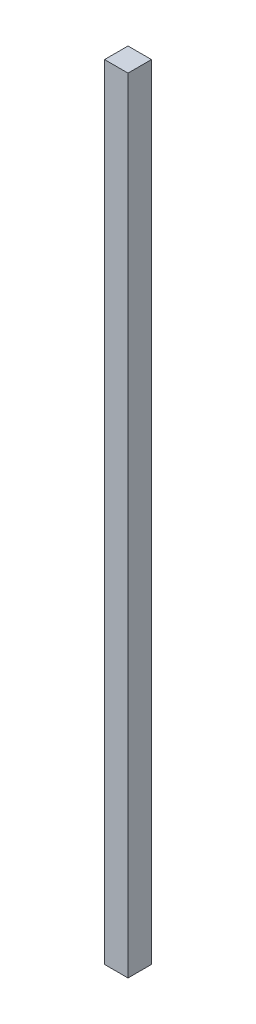
ISO-10303-21;
HEADER;
FILE_DESCRIPTION(('STEP AP214'),'2;1');
FILE_NAME('part.step','',(''),(''),'','','');
FILE_SCHEMA(('AUTOMOTIVE_DESIGN { 1 0 10303 214 1 1 1 1 }'));
ENDSEC;
DATA;
#1=APPLICATION_CONTEXT('core data for automotive mechanical design processes');
#2=APPLICATION_PROTOCOL_DEFINITION('international standard','automotive_design',2000,#1);
#3=PRODUCT_CONTEXT('',#1,'mechanical');
#4=PRODUCT('Part','Part','',(#3));
#5=PRODUCT_RELATED_PRODUCT_CATEGORY('part','',(#4));
#6=PRODUCT_DEFINITION_FORMATION('','',#4);
#7=PRODUCT_DEFINITION_CONTEXT('part definition',#1,'design');
#8=PRODUCT_DEFINITION('design','',#6,#7);
#9=PRODUCT_DEFINITION_SHAPE('','',#8);
#10=(LENGTH_UNIT() NAMED_UNIT(*) SI_UNIT(.MILLI.,.METRE.));
#11=(NAMED_UNIT(*) PLANE_ANGLE_UNIT() SI_UNIT($,.RADIAN.));
#12=(NAMED_UNIT(*) SI_UNIT($,.STERADIAN.) SOLID_ANGLE_UNIT());
#13=UNCERTAINTY_MEASURE_WITH_UNIT(LENGTH_MEASURE(1.E-05),#10,'distance_accuracy_value','');
#14=(GEOMETRIC_REPRESENTATION_CONTEXT(3) GLOBAL_UNCERTAINTY_ASSIGNED_CONTEXT((#13)) GLOBAL_UNIT_ASSIGNED_CONTEXT((#10,
#11,#12)) REPRESENTATION_CONTEXT('',''));
#15=CARTESIAN_POINT('',(0.,0.,0.));
#16=DIRECTION('',(0.,0.,1.));
#17=DIRECTION('',(1.,0.,0.));
#18=AXIS2_PLACEMENT_3D('',#15,#16,#17);
#19=CARTESIAN_POINT('',(-5.,334.,-5.));
#20=DIRECTION('',(1.,0.,0.));
#21=DIRECTION('',(0.,0.,-1.));
#22=AXIS2_PLACEMENT_3D('',#19,#20,#21);
#23=PLANE('',#22);
#24=DIRECTION('',(0.,0.,1.));
#25=VECTOR('',#24,1.);
#26=CARTESIAN_POINT('',(-5.,0.,-5.));
#27=LINE('',#26,#25);
#28=CARTESIAN_POINT('',(-5.,0.,-5.));
#29=VERTEX_POINT('',#28);
#30=CARTESIAN_POINT('',(-5.,0.,5.));
#31=VERTEX_POINT('',#30);
#32=EDGE_CURVE('E98',#29,#31,#27,.T.);
#33=ORIENTED_EDGE('',*,*,#32,.T.);
#34=DIRECTION('',(0.,-1.,0.));
#35=VECTOR('',#34,1.);
#36=CARTESIAN_POINT('',(-5.,334.,5.));
#37=LINE('',#36,#35);
#38=CARTESIAN_POINT('',(-5.,334.,5.));
#39=VERTEX_POINT('',#38);
#40=EDGE_CURVE('E11',#39,#31,#37,.T.);
#41=ORIENTED_EDGE('',*,*,#40,.F.);
#42=DIRECTION('',(0.,0.,1.));
#43=VECTOR('',#42,1.);
#44=CARTESIAN_POINT('',(-5.,334.,-5.));
#45=LINE('',#44,#43);
#46=CARTESIAN_POINT('',(-5.,334.,-5.));
#47=VERTEX_POINT('',#46);
#48=EDGE_CURVE('E86',#47,#39,#45,.T.);
#49=ORIENTED_EDGE('',*,*,#48,.F.);
#50=DIRECTION('',(0.,-1.,0.));
#51=VECTOR('',#50,1.);
#52=CARTESIAN_POINT('',(-5.,334.,-5.));
#53=LINE('',#52,#51);
#54=EDGE_CURVE('E94',#47,#29,#53,.T.);
#55=ORIENTED_EDGE('',*,*,#54,.T.);
#56=EDGE_LOOP('',(#33,#41,#49,#55));
#57=FACE_BOUND('',#56,.T.);
#58=ADVANCED_FACE('F35',(#57),#23,.F.);
#59=CARTESIAN_POINT('',(5.,334.,5.));
#60=DIRECTION('',(0.,0.,-1.));
#61=DIRECTION('',(-1.,0.,0.));
#62=AXIS2_PLACEMENT_3D('',#59,#60,#61);
#63=PLANE('',#62);
#64=DIRECTION('',(1.,0.,0.));
#65=VECTOR('',#64,1.);
#66=CARTESIAN_POINT('',(5.,0.,5.));
#67=LINE('',#66,#65);
#68=CARTESIAN_POINT('',(5.,0.,5.));
#69=VERTEX_POINT('',#68);
#70=EDGE_CURVE('E90',#31,#69,#67,.T.);
#71=ORIENTED_EDGE('',*,*,#70,.T.);
#72=DIRECTION('',(0.,-1.,0.));
#73=VECTOR('',#72,1.);
#74=CARTESIAN_POINT('',(5.,334.,5.));
#75=LINE('',#74,#73);
#76=CARTESIAN_POINT('',(5.,334.,5.));
#77=VERTEX_POINT('',#76);
#78=EDGE_CURVE('E43',#77,#69,#75,.T.);
#79=ORIENTED_EDGE('',*,*,#78,.F.);
#80=DIRECTION('',(1.,0.,0.));
#81=VECTOR('',#80,1.);
#82=CARTESIAN_POINT('',(5.,334.,5.));
#83=LINE('',#82,#81);
#84=EDGE_CURVE('E81',#39,#77,#83,.T.);
#85=ORIENTED_EDGE('',*,*,#84,.F.);
#86=ORIENTED_EDGE('',*,*,#40,.T.);
#87=EDGE_LOOP('',(#71,#79,#85,#86));
#88=FACE_BOUND('',#87,.T.);
#89=ADVANCED_FACE('F89',(#88),#63,.F.);
#90=CARTESIAN_POINT('',(5.,334.,-5.));
#91=DIRECTION('',(-1.,0.,0.));
#92=DIRECTION('',(0.,0.,1.));
#93=AXIS2_PLACEMENT_3D('',#90,#91,#92);
#94=PLANE('',#93);
#95=DIRECTION('',(0.,0.,-1.));
#96=VECTOR('',#95,1.);
#97=CARTESIAN_POINT('',(5.,0.,-5.));
#98=LINE('',#97,#96);
#99=CARTESIAN_POINT('',(5.,0.,-5.));
#100=VERTEX_POINT('',#99);
#101=EDGE_CURVE('E68',#69,#100,#98,.T.);
#102=ORIENTED_EDGE('',*,*,#101,.T.);
#103=DIRECTION('',(0.,-1.,0.));
#104=VECTOR('',#103,1.);
#105=CARTESIAN_POINT('',(5.,334.,-5.));
#106=LINE('',#105,#104);
#107=CARTESIAN_POINT('',(5.,334.,-5.));
#108=VERTEX_POINT('',#107);
#109=EDGE_CURVE('E91',#108,#100,#106,.T.);
#110=ORIENTED_EDGE('',*,*,#109,.F.);
#111=DIRECTION('',(0.,0.,-1.));
#112=VECTOR('',#111,1.);
#113=CARTESIAN_POINT('',(5.,334.,-5.));
#114=LINE('',#113,#112);
#115=EDGE_CURVE('E84',#77,#108,#114,.T.);
#116=ORIENTED_EDGE('',*,*,#115,.F.);
#117=ORIENTED_EDGE('',*,*,#78,.T.);
#118=EDGE_LOOP('',(#102,#110,#116,#117));
#119=FACE_BOUND('',#118,.T.);
#120=ADVANCED_FACE('F92',(#119),#94,.F.);
#121=CARTESIAN_POINT('',(5.,334.,-5.));
#122=DIRECTION('',(0.,0.,1.));
#123=DIRECTION('',(1.,0.,0.));
#124=AXIS2_PLACEMENT_3D('',#121,#122,#123);
#125=PLANE('',#124);
#126=DIRECTION('',(-1.,0.,0.));
#127=VECTOR('',#126,1.);
#128=CARTESIAN_POINT('',(5.,0.,-5.));
#129=LINE('',#128,#127);
#130=EDGE_CURVE('E74',#100,#29,#129,.T.);
#131=ORIENTED_EDGE('',*,*,#130,.T.);
#132=ORIENTED_EDGE('',*,*,#54,.F.);
#133=DIRECTION('',(-1.,0.,0.));
#134=VECTOR('',#133,1.);
#135=CARTESIAN_POINT('',(5.,334.,-5.));
#136=LINE('',#135,#134);
#137=EDGE_CURVE('E51',#108,#47,#136,.T.);
#138=ORIENTED_EDGE('',*,*,#137,.F.);
#139=ORIENTED_EDGE('',*,*,#109,.T.);
#140=EDGE_LOOP('',(#131,#132,#138,#139));
#141=FACE_BOUND('',#140,.T.);
#142=ADVANCED_FACE('F105',(#141),#125,.F.);
#143=CARTESIAN_POINT('',(0.,334.,0.));
#144=DIRECTION('',(0.,-1.,0.));
#145=DIRECTION('',(0.,0.,-1.));
#146=AXIS2_PLACEMENT_3D('',#143,#144,#145);
#147=PLANE('',#146);
#148=ORIENTED_EDGE('',*,*,#48,.T.);
#149=ORIENTED_EDGE('',*,*,#84,.T.);
#150=ORIENTED_EDGE('',*,*,#115,.T.);
#151=ORIENTED_EDGE('',*,*,#137,.T.);
#152=EDGE_LOOP('',(#148,#149,#150,#151));
#153=FACE_BOUND('',#152,.T.);
#154=ADVANCED_FACE('F82',(#153),#147,.F.);
#155=CARTESIAN_POINT('',(0.,0.,0.));
#156=DIRECTION('',(0.,-1.,0.));
#157=DIRECTION('',(0.,0.,-1.));
#158=AXIS2_PLACEMENT_3D('',#155,#156,#157);
#159=PLANE('',#158);
#160=ORIENTED_EDGE('',*,*,#32,.F.);
#161=ORIENTED_EDGE('',*,*,#130,.F.);
#162=ORIENTED_EDGE('',*,*,#101,.F.);
#163=ORIENTED_EDGE('',*,*,#70,.F.);
#164=EDGE_LOOP('',(#160,#161,#162,#163));
#165=FACE_BOUND('',#164,.T.);
#166=ADVANCED_FACE('F108',(#165),#159,.T.);
#167=CLOSED_SHELL('',(#58,#89,#120,#142,#154,#166));
#168=MANIFOLD_SOLID_BREP('B2',#167);
#169=ADVANCED_BREP_SHAPE_REPRESENTATION('',(#18,#168),#14);
#170=SHAPE_DEFINITION_REPRESENTATION(#9,#169);
ENDSEC;
END-ISO-10303-21;
